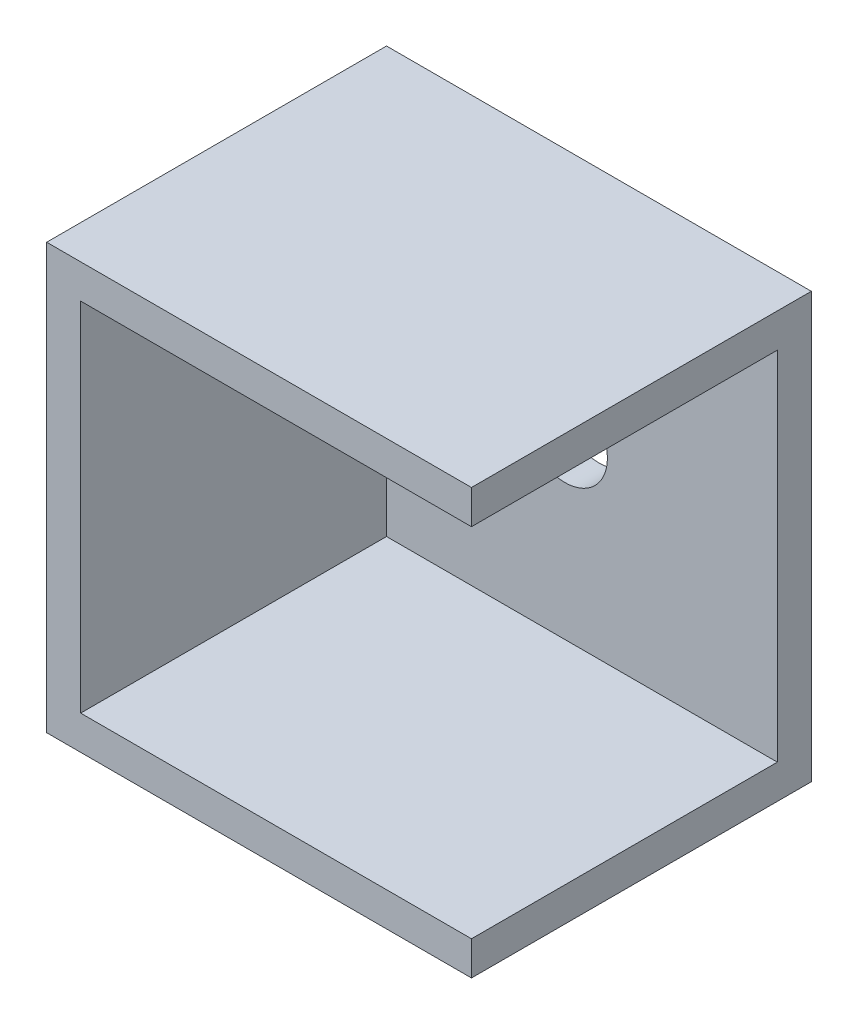
ISO-10303-21;
HEADER;
FILE_DESCRIPTION(('STEP AP214'),'2;1');
FILE_NAME('part.step','',(''),(''),'','','');
FILE_SCHEMA(('AUTOMOTIVE_DESIGN { 1 0 10303 214 1 1 1 1 }'));
ENDSEC;
DATA;
#1=APPLICATION_CONTEXT('core data for automotive mechanical design processes');
#2=APPLICATION_PROTOCOL_DEFINITION('international standard','automotive_design',2000,#1);
#3=PRODUCT_CONTEXT('',#1,'mechanical');
#4=PRODUCT('Part','Part','',(#3));
#5=PRODUCT_RELATED_PRODUCT_CATEGORY('part','',(#4));
#6=PRODUCT_DEFINITION_FORMATION('','',#4);
#7=PRODUCT_DEFINITION_CONTEXT('part definition',#1,'design');
#8=PRODUCT_DEFINITION('design','',#6,#7);
#9=PRODUCT_DEFINITION_SHAPE('','',#8);
#10=(LENGTH_UNIT() NAMED_UNIT(*) SI_UNIT(.MILLI.,.METRE.));
#11=(NAMED_UNIT(*) PLANE_ANGLE_UNIT() SI_UNIT($,.RADIAN.));
#12=(NAMED_UNIT(*) SI_UNIT($,.STERADIAN.) SOLID_ANGLE_UNIT());
#13=UNCERTAINTY_MEASURE_WITH_UNIT(LENGTH_MEASURE(1.E-05),#10,'distance_accuracy_value','');
#14=(GEOMETRIC_REPRESENTATION_CONTEXT(3) GLOBAL_UNCERTAINTY_ASSIGNED_CONTEXT((#13)) GLOBAL_UNIT_ASSIGNED_CONTEXT((#10,
#11,#12)) REPRESENTATION_CONTEXT('',''));
#15=CARTESIAN_POINT('',(0.,0.,0.));
#16=DIRECTION('',(0.,0.,1.));
#17=DIRECTION('',(1.,0.,0.));
#18=AXIS2_PLACEMENT_3D('',#15,#16,#17);
#19=CARTESIAN_POINT('',(12.5,12.5,20.));
#20=DIRECTION('',(-1.,0.,0.));
#21=DIRECTION('',(0.,-1.,0.));
#22=AXIS2_PLACEMENT_3D('',#19,#20,#21);
#23=PLANE('',#22);
#24=DIRECTION('',(0.,1.,0.));
#25=VECTOR('',#24,1.);
#26=CARTESIAN_POINT('',(12.5,12.5,20.));
#27=LINE('',#26,#25);
#28=CARTESIAN_POINT('',(12.5,10.5,20.));
#29=VERTEX_POINT('',#28);
#30=CARTESIAN_POINT('',(12.5,12.5,20.));
#31=VERTEX_POINT('',#30);
#32=EDGE_CURVE('E93',#29,#31,#27,.T.);
#33=ORIENTED_EDGE('',*,*,#32,.F.);
#34=DIRECTION('',(0.,0.,-1.));
#35=VECTOR('',#34,1.);
#36=CARTESIAN_POINT('',(12.5,10.5,20.));
#37=LINE('',#36,#35);
#38=CARTESIAN_POINT('',(12.5,10.5,2.));
#39=VERTEX_POINT('',#38);
#40=EDGE_CURVE('E134',#29,#39,#37,.T.);
#41=ORIENTED_EDGE('',*,*,#40,.T.);
#42=DIRECTION('',(0.,1.,0.));
#43=VECTOR('',#42,1.);
#44=CARTESIAN_POINT('',(12.5,12.5,2.));
#45=LINE('',#44,#43);
#46=CARTESIAN_POINT('',(12.5,-10.5,2.));
#47=VERTEX_POINT('',#46);
#48=EDGE_CURVE('E122',#47,#39,#45,.T.);
#49=ORIENTED_EDGE('',*,*,#48,.F.);
#50=DIRECTION('',(0.,0.,-1.));
#51=VECTOR('',#50,1.);
#52=CARTESIAN_POINT('',(12.5,-10.5,20.));
#53=LINE('',#52,#51);
#54=CARTESIAN_POINT('',(12.5,-10.5,20.));
#55=VERTEX_POINT('',#54);
#56=EDGE_CURVE('E144',#55,#47,#53,.T.);
#57=ORIENTED_EDGE('',*,*,#56,.F.);
#58=CARTESIAN_POINT('',(12.5,-12.5,20.));
#59=VERTEX_POINT('',#58);
#60=EDGE_CURVE('E163',#59,#55,#27,.T.);
#61=ORIENTED_EDGE('',*,*,#60,.F.);
#62=DIRECTION('',(0.,0.,-1.));
#63=VECTOR('',#62,1.);
#64=CARTESIAN_POINT('',(12.5,-12.5,20.));
#65=LINE('',#64,#63);
#66=CARTESIAN_POINT('',(12.5,-12.5,0.));
#67=VERTEX_POINT('',#66);
#68=EDGE_CURVE('E174',#59,#67,#65,.T.);
#69=ORIENTED_EDGE('',*,*,#68,.T.);
#70=DIRECTION('',(0.,1.,0.));
#71=VECTOR('',#70,1.);
#72=CARTESIAN_POINT('',(12.5,12.5,0.));
#73=LINE('',#72,#71);
#74=CARTESIAN_POINT('',(12.5,12.5,0.));
#75=VERTEX_POINT('',#74);
#76=EDGE_CURVE('E162',#67,#75,#73,.T.);
#77=ORIENTED_EDGE('',*,*,#76,.T.);
#78=DIRECTION('',(0.,0.,-1.));
#79=VECTOR('',#78,1.);
#80=CARTESIAN_POINT('',(12.5,12.5,20.));
#81=LINE('',#80,#79);
#82=EDGE_CURVE('E11',#31,#75,#81,.T.);
#83=ORIENTED_EDGE('',*,*,#82,.F.);
#84=EDGE_LOOP('',(#33,#41,#49,#57,#61,#69,#77,#83));
#85=FACE_BOUND('',#84,.T.);
#86=ADVANCED_FACE('F41',(#85),#23,.F.);
#87=CARTESIAN_POINT('',(-12.5,12.5,20.));
#88=DIRECTION('',(0.,-1.,0.));
#89=DIRECTION('',(0.,0.,-1.));
#90=AXIS2_PLACEMENT_3D('',#87,#88,#89);
#91=PLANE('',#90);
#92=DIRECTION('',(-1.,0.,0.));
#93=VECTOR('',#92,1.);
#94=CARTESIAN_POINT('',(-12.5,12.5,0.));
#95=LINE('',#94,#93);
#96=CARTESIAN_POINT('',(-12.5,12.5,0.));
#97=VERTEX_POINT('',#96);
#98=EDGE_CURVE('E178',#75,#97,#95,.T.);
#99=ORIENTED_EDGE('',*,*,#98,.T.);
#100=DIRECTION('',(0.,0.,-1.));
#101=VECTOR('',#100,1.);
#102=CARTESIAN_POINT('',(-12.5,12.5,20.));
#103=LINE('',#102,#101);
#104=CARTESIAN_POINT('',(-12.5,12.5,20.));
#105=VERTEX_POINT('',#104);
#106=EDGE_CURVE('E49',#105,#97,#103,.T.);
#107=ORIENTED_EDGE('',*,*,#106,.F.);
#108=DIRECTION('',(-1.,0.,0.));
#109=VECTOR('',#108,1.);
#110=CARTESIAN_POINT('',(-12.5,12.5,20.));
#111=LINE('',#110,#109);
#112=EDGE_CURVE('E166',#31,#105,#111,.T.);
#113=ORIENTED_EDGE('',*,*,#112,.F.);
#114=ORIENTED_EDGE('',*,*,#82,.T.);
#115=EDGE_LOOP('',(#99,#107,#113,#114));
#116=FACE_BOUND('',#115,.T.);
#117=ADVANCED_FACE('F215',(#116),#91,.F.);
#118=CARTESIAN_POINT('',(-12.5,12.5,20.));
#119=DIRECTION('',(1.,0.,0.));
#120=DIRECTION('',(0.,1.,0.));
#121=AXIS2_PLACEMENT_3D('',#118,#119,#120);
#122=PLANE('',#121);
#123=DIRECTION('',(0.,-1.,0.));
#124=VECTOR('',#123,1.);
#125=CARTESIAN_POINT('',(-12.5,12.5,0.));
#126=LINE('',#125,#124);
#127=CARTESIAN_POINT('',(-12.5,-12.5,0.));
#128=VERTEX_POINT('',#127);
#129=EDGE_CURVE('E181',#97,#128,#126,.T.);
#130=ORIENTED_EDGE('',*,*,#129,.T.);
#131=DIRECTION('',(0.,0.,-1.));
#132=VECTOR('',#131,1.);
#133=CARTESIAN_POINT('',(-12.5,-12.5,20.));
#134=LINE('',#133,#132);
#135=CARTESIAN_POINT('',(-12.5,-12.5,20.));
#136=VERTEX_POINT('',#135);
#137=EDGE_CURVE('E188',#136,#128,#134,.T.);
#138=ORIENTED_EDGE('',*,*,#137,.F.);
#139=DIRECTION('',(0.,-1.,0.));
#140=VECTOR('',#139,1.);
#141=CARTESIAN_POINT('',(-12.5,12.5,20.));
#142=LINE('',#141,#140);
#143=EDGE_CURVE('E169',#105,#136,#142,.T.);
#144=ORIENTED_EDGE('',*,*,#143,.F.);
#145=ORIENTED_EDGE('',*,*,#106,.T.);
#146=EDGE_LOOP('',(#130,#138,#144,#145));
#147=FACE_BOUND('',#146,.T.);
#148=ADVANCED_FACE('F196',(#147),#122,.F.);
#149=CARTESIAN_POINT('',(-12.5,-12.5,20.));
#150=DIRECTION('',(0.,1.,0.));
#151=DIRECTION('',(0.,0.,1.));
#152=AXIS2_PLACEMENT_3D('',#149,#150,#151);
#153=PLANE('',#152);
#154=DIRECTION('',(1.,0.,0.));
#155=VECTOR('',#154,1.);
#156=CARTESIAN_POINT('',(-12.5,-12.5,0.));
#157=LINE('',#156,#155);
#158=EDGE_CURVE('E86',#128,#67,#157,.T.);
#159=ORIENTED_EDGE('',*,*,#158,.T.);
#160=ORIENTED_EDGE('',*,*,#68,.F.);
#161=DIRECTION('',(1.,0.,0.));
#162=VECTOR('',#161,1.);
#163=CARTESIAN_POINT('',(-12.5,-12.5,20.));
#164=LINE('',#163,#162);
#165=EDGE_CURVE('E65',#136,#59,#164,.T.);
#166=ORIENTED_EDGE('',*,*,#165,.F.);
#167=ORIENTED_EDGE('',*,*,#137,.T.);
#168=EDGE_LOOP('',(#159,#160,#166,#167));
#169=FACE_BOUND('',#168,.T.);
#170=ADVANCED_FACE('F206',(#169),#153,.F.);
#171=CARTESIAN_POINT('',(0.,0.,20.));
#172=DIRECTION('',(0.,0.,1.));
#173=DIRECTION('',(1.,0.,0.));
#174=AXIS2_PLACEMENT_3D('',#171,#172,#173);
#175=PLANE('',#174);
#176=DIRECTION('',(-1.,0.,0.));
#177=VECTOR('',#176,1.);
#178=CARTESIAN_POINT('',(-12.5,10.5,20.));
#179=LINE('',#178,#177);
#180=CARTESIAN_POINT('',(-10.5,10.5,20.));
#181=VERTEX_POINT('',#180);
#182=EDGE_CURVE('E130',#29,#181,#179,.T.);
#183=ORIENTED_EDGE('',*,*,#182,.F.);
#184=ORIENTED_EDGE('',*,*,#32,.T.);
#185=ORIENTED_EDGE('',*,*,#112,.T.);
#186=ORIENTED_EDGE('',*,*,#143,.T.);
#187=ORIENTED_EDGE('',*,*,#165,.T.);
#188=ORIENTED_EDGE('',*,*,#60,.T.);
#189=DIRECTION('',(1.,0.,0.));
#190=VECTOR('',#189,1.);
#191=CARTESIAN_POINT('',(-12.5,-10.5,20.));
#192=LINE('',#191,#190);
#193=CARTESIAN_POINT('',(-10.5,-10.5,20.));
#194=VERTEX_POINT('',#193);
#195=EDGE_CURVE('E151',#194,#55,#192,.T.);
#196=ORIENTED_EDGE('',*,*,#195,.F.);
#197=DIRECTION('',(0.,-1.,0.));
#198=VECTOR('',#197,1.);
#199=CARTESIAN_POINT('',(-10.5,12.5,20.));
#200=LINE('',#199,#198);
#201=EDGE_CURVE('E148',#181,#194,#200,.T.);
#202=ORIENTED_EDGE('',*,*,#201,.F.);
#203=EDGE_LOOP('',(#183,#184,#185,#186,#187,#188,#196,#202));
#204=FACE_BOUND('',#203,.T.);
#205=ADVANCED_FACE('F208',(#204),#175,.T.);
#206=CARTESIAN_POINT('',(0.,0.,0.));
#207=DIRECTION('',(0.,0.,1.));
#208=DIRECTION('',(1.,0.,0.));
#209=AXIS2_PLACEMENT_3D('',#206,#207,#208);
#210=PLANE('',#209);
#211=CARTESIAN_POINT('',(0.,0.,0.));
#212=DIRECTION('',(0.,0.,1.));
#213=DIRECTION('',(1.,0.,0.));
#214=AXIS2_PLACEMENT_3D('',#211,#212,#213);
#215=CIRCLE('',#214,2.5);
#216=CARTESIAN_POINT('',(2.5,0.,0.));
#217=VERTEX_POINT('',#216);
#218=EDGE_CURVE('E159',#217,#217,#215,.T.);
#219=ORIENTED_EDGE('',*,*,#218,.T.);
#220=EDGE_LOOP('',(#219));
#221=FACE_BOUND('',#220,.T.);
#222=ORIENTED_EDGE('',*,*,#76,.F.);
#223=ORIENTED_EDGE('',*,*,#158,.F.);
#224=ORIENTED_EDGE('',*,*,#129,.F.);
#225=ORIENTED_EDGE('',*,*,#98,.F.);
#226=EDGE_LOOP('',(#222,#223,#224,#225));
#227=FACE_BOUND('',#226,.T.);
#228=ADVANCED_FACE('F201',(#221,#227),#210,.F.);
#229=CARTESIAN_POINT('',(-12.5,10.5,20.));
#230=DIRECTION('',(0.,-1.,0.));
#231=DIRECTION('',(0.,0.,-1.));
#232=AXIS2_PLACEMENT_3D('',#229,#230,#231);
#233=PLANE('',#232);
#234=DIRECTION('',(-1.,0.,0.));
#235=VECTOR('',#234,1.);
#236=CARTESIAN_POINT('',(-12.5,10.5,2.));
#237=LINE('',#236,#235);
#238=CARTESIAN_POINT('',(-10.5,10.5,2.));
#239=VERTEX_POINT('',#238);
#240=EDGE_CURVE('E116',#39,#239,#237,.T.);
#241=ORIENTED_EDGE('',*,*,#240,.F.);
#242=ORIENTED_EDGE('',*,*,#40,.F.);
#243=ORIENTED_EDGE('',*,*,#182,.T.);
#244=DIRECTION('',(0.,0.,-1.));
#245=VECTOR('',#244,1.);
#246=CARTESIAN_POINT('',(-10.5,10.5,20.));
#247=LINE('',#246,#245);
#248=EDGE_CURVE('E128',#181,#239,#247,.T.);
#249=ORIENTED_EDGE('',*,*,#248,.T.);
#250=EDGE_LOOP('',(#241,#242,#243,#249));
#251=FACE_BOUND('',#250,.T.);
#252=ADVANCED_FACE('F129',(#251),#233,.T.);
#253=CARTESIAN_POINT('',(-10.5,12.5,20.));
#254=DIRECTION('',(1.,0.,0.));
#255=DIRECTION('',(0.,1.,0.));
#256=AXIS2_PLACEMENT_3D('',#253,#254,#255);
#257=PLANE('',#256);
#258=DIRECTION('',(0.,-1.,0.));
#259=VECTOR('',#258,1.);
#260=CARTESIAN_POINT('',(-10.5,12.5,2.));
#261=LINE('',#260,#259);
#262=CARTESIAN_POINT('',(-10.5,-10.5,2.));
#263=VERTEX_POINT('',#262);
#264=EDGE_CURVE('E120',#239,#263,#261,.T.);
#265=ORIENTED_EDGE('',*,*,#264,.F.);
#266=ORIENTED_EDGE('',*,*,#248,.F.);
#267=ORIENTED_EDGE('',*,*,#201,.T.);
#268=DIRECTION('',(0.,0.,-1.));
#269=VECTOR('',#268,1.);
#270=CARTESIAN_POINT('',(-10.5,-10.5,20.));
#271=LINE('',#270,#269);
#272=EDGE_CURVE('E56',#194,#263,#271,.T.);
#273=ORIENTED_EDGE('',*,*,#272,.T.);
#274=EDGE_LOOP('',(#265,#266,#267,#273));
#275=FACE_BOUND('',#274,.T.);
#276=ADVANCED_FACE('F136',(#275),#257,.T.);
#277=CARTESIAN_POINT('',(-12.5,-10.5,20.));
#278=DIRECTION('',(0.,1.,0.));
#279=DIRECTION('',(0.,0.,1.));
#280=AXIS2_PLACEMENT_3D('',#277,#278,#279);
#281=PLANE('',#280);
#282=DIRECTION('',(1.,0.,0.));
#283=VECTOR('',#282,1.);
#284=CARTESIAN_POINT('',(-12.5,-10.5,2.));
#285=LINE('',#284,#283);
#286=EDGE_CURVE('E138',#263,#47,#285,.T.);
#287=ORIENTED_EDGE('',*,*,#286,.F.);
#288=ORIENTED_EDGE('',*,*,#272,.F.);
#289=ORIENTED_EDGE('',*,*,#195,.T.);
#290=ORIENTED_EDGE('',*,*,#56,.T.);
#291=EDGE_LOOP('',(#287,#288,#289,#290));
#292=FACE_BOUND('',#291,.T.);
#293=ADVANCED_FACE('F226',(#292),#281,.T.);
#294=CARTESIAN_POINT('',(0.,0.,2.));
#295=DIRECTION('',(0.,0.,1.));
#296=DIRECTION('',(1.,0.,0.));
#297=AXIS2_PLACEMENT_3D('',#294,#295,#296);
#298=PLANE('',#297);
#299=CARTESIAN_POINT('',(0.,0.,2.));
#300=DIRECTION('',(0.,0.,1.));
#301=DIRECTION('',(1.,0.,0.));
#302=AXIS2_PLACEMENT_3D('',#299,#300,#301);
#303=CIRCLE('',#302,2.5);
#304=CARTESIAN_POINT('',(2.5,0.,2.));
#305=VERTEX_POINT('',#304);
#306=EDGE_CURVE('E247',#305,#305,#303,.T.);
#307=ORIENTED_EDGE('',*,*,#306,.F.);
#308=EDGE_LOOP('',(#307));
#309=FACE_BOUND('',#308,.T.);
#310=ORIENTED_EDGE('',*,*,#48,.T.);
#311=ORIENTED_EDGE('',*,*,#240,.T.);
#312=ORIENTED_EDGE('',*,*,#264,.T.);
#313=ORIENTED_EDGE('',*,*,#286,.T.);
#314=EDGE_LOOP('',(#310,#311,#312,#313));
#315=FACE_BOUND('',#314,.T.);
#316=ADVANCED_FACE('F118',(#309,#315),#298,.T.);
#317=CARTESIAN_POINT('',(0.,0.,-2.99999999999999));
#318=DIRECTION('',(0.,0.,1.));
#319=DIRECTION('',(1.,0.,0.));
#320=AXIS2_PLACEMENT_3D('',#317,#318,#319);
#321=CYLINDRICAL_SURFACE('',#320,2.5);
#322=ORIENTED_EDGE('',*,*,#306,.T.);
#323=EDGE_LOOP('',(#322));
#324=FACE_BOUND('',#323,.T.);
#325=ORIENTED_EDGE('',*,*,#218,.F.);
#326=EDGE_LOOP('',(#325));
#327=FACE_BOUND('',#326,.T.);
#328=ADVANCED_FACE('F233',(#324,#327),#321,.F.);
#329=CLOSED_SHELL('',(#86,#117,#148,#170,#205,#228,#252,#276,#293,#316,#328));
#330=MANIFOLD_SOLID_BREP('B2',#329);
#331=ADVANCED_BREP_SHAPE_REPRESENTATION('',(#18,#330),#14);
#332=SHAPE_DEFINITION_REPRESENTATION(#9,#331);
ENDSEC;
END-ISO-10303-21;
